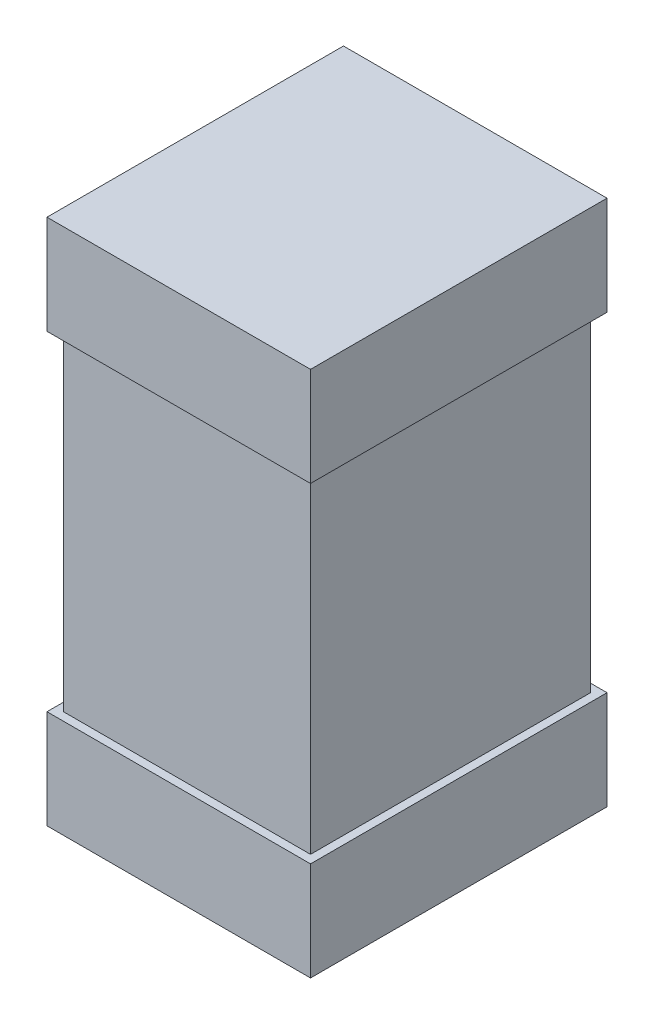
ISO-10303-21;
HEADER;
FILE_DESCRIPTION(('STEP AP214'),'2;1');
FILE_NAME('part.step','',(''),(''),'','','');
FILE_SCHEMA(('AUTOMOTIVE_DESIGN { 1 0 10303 214 1 1 1 1 }'));
ENDSEC;
DATA;
#1=APPLICATION_CONTEXT('core data for automotive mechanical design processes');
#2=APPLICATION_PROTOCOL_DEFINITION('international standard','automotive_design',2000,#1);
#3=PRODUCT_CONTEXT('',#1,'mechanical');
#4=PRODUCT('Part','Part','',(#3));
#5=PRODUCT_RELATED_PRODUCT_CATEGORY('part','',(#4));
#6=PRODUCT_DEFINITION_FORMATION('','',#4);
#7=PRODUCT_DEFINITION_CONTEXT('part definition',#1,'design');
#8=PRODUCT_DEFINITION('design','',#6,#7);
#9=PRODUCT_DEFINITION_SHAPE('','',#8);
#10=(LENGTH_UNIT() NAMED_UNIT(*) SI_UNIT(.MILLI.,.METRE.));
#11=(NAMED_UNIT(*) PLANE_ANGLE_UNIT() SI_UNIT($,.RADIAN.));
#12=(NAMED_UNIT(*) SI_UNIT($,.STERADIAN.) SOLID_ANGLE_UNIT());
#13=UNCERTAINTY_MEASURE_WITH_UNIT(LENGTH_MEASURE(1.E-05),#10,'distance_accuracy_value','');
#14=(GEOMETRIC_REPRESENTATION_CONTEXT(3) GLOBAL_UNCERTAINTY_ASSIGNED_CONTEXT((#13)) GLOBAL_UNIT_ASSIGNED_CONTEXT((#10,
#11,#12)) REPRESENTATION_CONTEXT('',''));
#15=CARTESIAN_POINT('',(0.,0.,0.));
#16=DIRECTION('',(0.,0.,1.));
#17=DIRECTION('',(1.,0.,0.));
#18=AXIS2_PLACEMENT_3D('',#15,#16,#17);
#19=CARTESIAN_POINT('',(-0.375,-0.8,-0.425));
#20=DIRECTION('',(0.,-1.,0.));
#21=DIRECTION('',(0.,0.,-1.));
#22=AXIS2_PLACEMENT_3D('',#19,#20,#21);
#23=PLANE('',#22);
#24=DIRECTION('',(0.,0.,-1.));
#25=VECTOR('',#24,1.);
#26=CARTESIAN_POINT('',(0.4,-0.8,-0.45));
#27=LINE('',#26,#25);
#28=CARTESIAN_POINT('',(0.4,-0.8,0.45));
#29=VERTEX_POINT('',#28);
#30=CARTESIAN_POINT('',(0.4,-0.8,-0.45));
#31=VERTEX_POINT('',#30);
#32=EDGE_CURVE('E107',#29,#31,#27,.T.);
#33=ORIENTED_EDGE('',*,*,#32,.F.);
#34=DIRECTION('',(1.,0.,0.));
#35=VECTOR('',#34,1.);
#36=CARTESIAN_POINT('',(0.4,-0.8,0.45));
#37=LINE('',#36,#35);
#38=CARTESIAN_POINT('',(-0.4,-0.8,0.45));
#39=VERTEX_POINT('',#38);
#40=EDGE_CURVE('E102',#39,#29,#37,.T.);
#41=ORIENTED_EDGE('',*,*,#40,.F.);
#42=DIRECTION('',(0.,0.,1.));
#43=VECTOR('',#42,1.);
#44=CARTESIAN_POINT('',(-0.4,-0.8,0.45));
#45=LINE('',#44,#43);
#46=CARTESIAN_POINT('',(-0.4,-0.8,-0.45));
#47=VERTEX_POINT('',#46);
#48=EDGE_CURVE('E117',#47,#39,#45,.T.);
#49=ORIENTED_EDGE('',*,*,#48,.F.);
#50=DIRECTION('',(-1.,0.,0.));
#51=VECTOR('',#50,1.);
#52=CARTESIAN_POINT('',(-0.4,-0.8,-0.45));
#53=LINE('',#52,#51);
#54=EDGE_CURVE('E19',#31,#47,#53,.T.);
#55=ORIENTED_EDGE('',*,*,#54,.F.);
#56=EDGE_LOOP('',(#33,#41,#49,#55));
#57=FACE_BOUND('',#56,.T.);
#58=ADVANCED_FACE('F16',(#57),#23,.T.);
#59=CARTESIAN_POINT('',(-0.375,0.8,-0.425));
#60=DIRECTION('',(0.,-1.,0.));
#61=DIRECTION('',(0.,0.,-1.));
#62=AXIS2_PLACEMENT_3D('',#59,#60,#61);
#63=PLANE('',#62);
#64=DIRECTION('',(0.,0.,1.));
#65=VECTOR('',#64,1.);
#66=CARTESIAN_POINT('',(-0.4,0.8,-0.45));
#67=LINE('',#66,#65);
#68=CARTESIAN_POINT('',(-0.4,0.8,0.45));
#69=VERTEX_POINT('',#68);
#70=CARTESIAN_POINT('',(-0.4,0.8,-0.45));
#71=VERTEX_POINT('',#70);
#72=EDGE_CURVE('E133',#69,#71,#67,.F.);
#73=ORIENTED_EDGE('',*,*,#72,.F.);
#74=DIRECTION('',(1.,0.,0.));
#75=VECTOR('',#74,1.);
#76=CARTESIAN_POINT('',(-0.4,0.8,0.45));
#77=LINE('',#76,#75);
#78=CARTESIAN_POINT('',(0.4,0.8,0.45));
#79=VERTEX_POINT('',#78);
#80=EDGE_CURVE('E135',#79,#69,#77,.F.);
#81=ORIENTED_EDGE('',*,*,#80,.F.);
#82=DIRECTION('',(0.,0.,-1.));
#83=VECTOR('',#82,1.);
#84=CARTESIAN_POINT('',(0.4,0.8,0.45));
#85=LINE('',#84,#83);
#86=CARTESIAN_POINT('',(0.4,0.8,-0.45));
#87=VERTEX_POINT('',#86);
#88=EDGE_CURVE('E139',#87,#79,#85,.F.);
#89=ORIENTED_EDGE('',*,*,#88,.F.);
#90=DIRECTION('',(-1.,0.,0.));
#91=VECTOR('',#90,1.);
#92=CARTESIAN_POINT('',(0.4,0.8,-0.45));
#93=LINE('',#92,#91);
#94=EDGE_CURVE('E143',#71,#87,#93,.F.);
#95=ORIENTED_EDGE('',*,*,#94,.F.);
#96=EDGE_LOOP('',(#73,#81,#89,#95));
#97=FACE_BOUND('',#96,.T.);
#98=ADVANCED_FACE('F235',(#97),#63,.F.);
#99=CARTESIAN_POINT('',(-0.4,-0.5,-0.45));
#100=DIRECTION('',(0.,0.,-1.));
#101=DIRECTION('',(-1.,0.,0.));
#102=AXIS2_PLACEMENT_3D('',#99,#100,#101);
#103=PLANE('',#102);
#104=DIRECTION('',(1.,0.,0.));
#105=VECTOR('',#104,1.);
#106=CARTESIAN_POINT('',(-0.4,-0.5,-0.45));
#107=LINE('',#106,#105);
#108=CARTESIAN_POINT('',(-0.4,-0.5,-0.45));
#109=VERTEX_POINT('',#108);
#110=CARTESIAN_POINT('',(0.4,-0.5,-0.45));
#111=VERTEX_POINT('',#110);
#112=EDGE_CURVE('E123',#109,#111,#107,.T.);
#113=ORIENTED_EDGE('',*,*,#112,.T.);
#114=DIRECTION('',(0.,1.,0.));
#115=VECTOR('',#114,1.);
#116=CARTESIAN_POINT('',(0.4,-0.5,-0.45));
#117=LINE('',#116,#115);
#118=EDGE_CURVE('E112',#31,#111,#117,.T.);
#119=ORIENTED_EDGE('',*,*,#118,.F.);
#120=ORIENTED_EDGE('',*,*,#54,.T.);
#121=DIRECTION('',(0.,1.,0.));
#122=VECTOR('',#121,1.);
#123=CARTESIAN_POINT('',(-0.4,-0.5,-0.45));
#124=LINE('',#123,#122);
#125=EDGE_CURVE('E131',#109,#47,#124,.F.);
#126=ORIENTED_EDGE('',*,*,#125,.F.);
#127=EDGE_LOOP('',(#113,#119,#120,#126));
#128=FACE_BOUND('',#127,.T.);
#129=ADVANCED_FACE('F122',(#128),#103,.T.);
#130=CARTESIAN_POINT('',(0.4,-0.5,-0.45));
#131=DIRECTION('',(1.,0.,0.));
#132=DIRECTION('',(0.,0.,-1.));
#133=AXIS2_PLACEMENT_3D('',#130,#131,#132);
#134=PLANE('',#133);
#135=DIRECTION('',(0.,0.,-1.));
#136=VECTOR('',#135,1.);
#137=CARTESIAN_POINT('',(0.4,-0.5,-0.45));
#138=LINE('',#137,#136);
#139=CARTESIAN_POINT('',(0.4,-0.5,0.45));
#140=VERTEX_POINT('',#139);
#141=EDGE_CURVE('E153',#111,#140,#138,.F.);
#142=ORIENTED_EDGE('',*,*,#141,.T.);
#143=DIRECTION('',(0.,1.,0.));
#144=VECTOR('',#143,1.);
#145=CARTESIAN_POINT('',(0.4,-0.5,0.45));
#146=LINE('',#145,#144);
#147=EDGE_CURVE('E114',#29,#140,#146,.T.);
#148=ORIENTED_EDGE('',*,*,#147,.F.);
#149=ORIENTED_EDGE('',*,*,#32,.T.);
#150=ORIENTED_EDGE('',*,*,#118,.T.);
#151=EDGE_LOOP('',(#142,#148,#149,#150));
#152=FACE_BOUND('',#151,.T.);
#153=ADVANCED_FACE('F110',(#152),#134,.T.);
#154=CARTESIAN_POINT('',(0.4,-0.5,0.45));
#155=DIRECTION('',(0.,0.,1.));
#156=DIRECTION('',(1.,0.,0.));
#157=AXIS2_PLACEMENT_3D('',#154,#155,#156);
#158=PLANE('',#157);
#159=DIRECTION('',(1.,0.,0.));
#160=VECTOR('',#159,1.);
#161=CARTESIAN_POINT('',(-0.4,-0.5,0.45));
#162=LINE('',#161,#160);
#163=CARTESIAN_POINT('',(-0.4,-0.5,0.45));
#164=VERTEX_POINT('',#163);
#165=EDGE_CURVE('E155',#140,#164,#162,.F.);
#166=ORIENTED_EDGE('',*,*,#165,.T.);
#167=DIRECTION('',(0.,1.,0.));
#168=VECTOR('',#167,1.);
#169=CARTESIAN_POINT('',(-0.4,-0.5,0.45));
#170=LINE('',#169,#168);
#171=EDGE_CURVE('E129',#39,#164,#170,.T.);
#172=ORIENTED_EDGE('',*,*,#171,.F.);
#173=ORIENTED_EDGE('',*,*,#40,.T.);
#174=ORIENTED_EDGE('',*,*,#147,.T.);
#175=EDGE_LOOP('',(#166,#172,#173,#174));
#176=FACE_BOUND('',#175,.T.);
#177=ADVANCED_FACE('F269',(#176),#158,.T.);
#178=CARTESIAN_POINT('',(-0.4,-0.5,0.45));
#179=DIRECTION('',(-1.,0.,0.));
#180=DIRECTION('',(0.,0.,1.));
#181=AXIS2_PLACEMENT_3D('',#178,#179,#180);
#182=PLANE('',#181);
#183=DIRECTION('',(0.,0.,-1.));
#184=VECTOR('',#183,1.);
#185=CARTESIAN_POINT('',(-0.4,-0.5,-0.45));
#186=LINE('',#185,#184);
#187=EDGE_CURVE('E158',#164,#109,#186,.T.);
#188=ORIENTED_EDGE('',*,*,#187,.T.);
#189=ORIENTED_EDGE('',*,*,#125,.T.);
#190=ORIENTED_EDGE('',*,*,#48,.T.);
#191=ORIENTED_EDGE('',*,*,#171,.T.);
#192=EDGE_LOOP('',(#188,#189,#190,#191));
#193=FACE_BOUND('',#192,.T.);
#194=ADVANCED_FACE('F266',(#193),#182,.T.);
#195=CARTESIAN_POINT('',(-0.4,0.5,-0.45));
#196=DIRECTION('',(-1.,0.,0.));
#197=DIRECTION('',(0.,0.,1.));
#198=AXIS2_PLACEMENT_3D('',#195,#196,#197);
#199=PLANE('',#198);
#200=DIRECTION('',(0.,0.,1.));
#201=VECTOR('',#200,1.);
#202=CARTESIAN_POINT('',(-0.4,0.5,-0.45));
#203=LINE('',#202,#201);
#204=CARTESIAN_POINT('',(-0.4,0.5,-0.45));
#205=VERTEX_POINT('',#204);
#206=CARTESIAN_POINT('',(-0.4,0.5,0.45));
#207=VERTEX_POINT('',#206);
#208=EDGE_CURVE('E171',#205,#207,#203,.T.);
#209=ORIENTED_EDGE('',*,*,#208,.T.);
#210=DIRECTION('',(0.,1.,0.));
#211=VECTOR('',#210,1.);
#212=CARTESIAN_POINT('',(-0.4,0.5,0.45));
#213=LINE('',#212,#211);
#214=EDGE_CURVE('E137',#69,#207,#213,.F.);
#215=ORIENTED_EDGE('',*,*,#214,.F.);
#216=ORIENTED_EDGE('',*,*,#72,.T.);
#217=DIRECTION('',(0.,1.,0.));
#218=VECTOR('',#217,1.);
#219=CARTESIAN_POINT('',(-0.4,0.5,-0.45));
#220=LINE('',#219,#218);
#221=EDGE_CURVE('E147',#205,#71,#220,.T.);
#222=ORIENTED_EDGE('',*,*,#221,.F.);
#223=EDGE_LOOP('',(#209,#215,#216,#222));
#224=FACE_BOUND('',#223,.T.);
#225=ADVANCED_FACE('F227',(#224),#199,.T.);
#226=CARTESIAN_POINT('',(-0.4,0.5,0.45));
#227=DIRECTION('',(0.,0.,1.));
#228=DIRECTION('',(1.,0.,0.));
#229=AXIS2_PLACEMENT_3D('',#226,#227,#228);
#230=PLANE('',#229);
#231=DIRECTION('',(1.,0.,0.));
#232=VECTOR('',#231,1.);
#233=CARTESIAN_POINT('',(-0.4,0.5,0.45));
#234=LINE('',#233,#232);
#235=CARTESIAN_POINT('',(0.4,0.5,0.45));
#236=VERTEX_POINT('',#235);
#237=EDGE_CURVE('E174',#207,#236,#234,.T.);
#238=ORIENTED_EDGE('',*,*,#237,.T.);
#239=DIRECTION('',(0.,1.,0.));
#240=VECTOR('',#239,1.);
#241=CARTESIAN_POINT('',(0.4,0.5,0.45));
#242=LINE('',#241,#240);
#243=EDGE_CURVE('E141',#79,#236,#242,.F.);
#244=ORIENTED_EDGE('',*,*,#243,.F.);
#245=ORIENTED_EDGE('',*,*,#80,.T.);
#246=ORIENTED_EDGE('',*,*,#214,.T.);
#247=EDGE_LOOP('',(#238,#244,#245,#246));
#248=FACE_BOUND('',#247,.T.);
#249=ADVANCED_FACE('F222',(#248),#230,.T.);
#250=CARTESIAN_POINT('',(0.4,0.5,0.45));
#251=DIRECTION('',(1.,0.,0.));
#252=DIRECTION('',(0.,0.,-1.));
#253=AXIS2_PLACEMENT_3D('',#250,#251,#252);
#254=PLANE('',#253);
#255=DIRECTION('',(0.,0.,1.));
#256=VECTOR('',#255,1.);
#257=CARTESIAN_POINT('',(0.4,0.5,-0.45));
#258=LINE('',#257,#256);
#259=CARTESIAN_POINT('',(0.4,0.5,-0.45));
#260=VERTEX_POINT('',#259);
#261=EDGE_CURVE('E177',#236,#260,#258,.F.);
#262=ORIENTED_EDGE('',*,*,#261,.T.);
#263=DIRECTION('',(0.,1.,0.));
#264=VECTOR('',#263,1.);
#265=CARTESIAN_POINT('',(0.4,0.5,-0.45));
#266=LINE('',#265,#264);
#267=EDGE_CURVE('E145',#87,#260,#266,.F.);
#268=ORIENTED_EDGE('',*,*,#267,.F.);
#269=ORIENTED_EDGE('',*,*,#88,.T.);
#270=ORIENTED_EDGE('',*,*,#243,.T.);
#271=EDGE_LOOP('',(#262,#268,#269,#270));
#272=FACE_BOUND('',#271,.T.);
#273=ADVANCED_FACE('F233',(#272),#254,.T.);
#274=CARTESIAN_POINT('',(0.4,0.5,-0.45));
#275=DIRECTION('',(0.,0.,-1.));
#276=DIRECTION('',(-1.,0.,0.));
#277=AXIS2_PLACEMENT_3D('',#274,#275,#276);
#278=PLANE('',#277);
#279=DIRECTION('',(1.,0.,0.));
#280=VECTOR('',#279,1.);
#281=CARTESIAN_POINT('',(-0.4,0.5,-0.45));
#282=LINE('',#281,#280);
#283=EDGE_CURVE('E180',#260,#205,#282,.F.);
#284=ORIENTED_EDGE('',*,*,#283,.T.);
#285=ORIENTED_EDGE('',*,*,#221,.T.);
#286=ORIENTED_EDGE('',*,*,#94,.T.);
#287=ORIENTED_EDGE('',*,*,#267,.T.);
#288=EDGE_LOOP('',(#284,#285,#286,#287));
#289=FACE_BOUND('',#288,.T.);
#290=ADVANCED_FACE('F231',(#289),#278,.T.);
#291=CARTESIAN_POINT('',(-0.375,-0.8,0.425));
#292=DIRECTION('',(1.,0.,0.));
#293=DIRECTION('',(0.,0.,-1.));
#294=AXIS2_PLACEMENT_3D('',#291,#292,#293);
#295=PLANE('',#294);
#296=DIRECTION('',(0.,1.,0.));
#297=VECTOR('',#296,1.);
#298=CARTESIAN_POINT('',(-0.375,-0.8,-0.425));
#299=LINE('',#298,#297);
#300=CARTESIAN_POINT('',(-0.375,0.5,-0.425));
#301=VERTEX_POINT('',#300);
#302=CARTESIAN_POINT('',(-0.375,-0.5,-0.425));
#303=VERTEX_POINT('',#302);
#304=EDGE_CURVE('E150',#301,#303,#299,.F.);
#305=ORIENTED_EDGE('',*,*,#304,.T.);
#306=DIRECTION('',(0.,0.,-1.));
#307=VECTOR('',#306,1.);
#308=CARTESIAN_POINT('',(-0.375,-0.5,-0.45));
#309=LINE('',#308,#307);
#310=CARTESIAN_POINT('',(-0.375,-0.5,0.425));
#311=VERTEX_POINT('',#310);
#312=EDGE_CURVE('E164',#303,#311,#309,.F.);
#313=ORIENTED_EDGE('',*,*,#312,.T.);
#314=DIRECTION('',(0.,1.,0.));
#315=VECTOR('',#314,1.);
#316=CARTESIAN_POINT('',(-0.375,-0.8,0.425));
#317=LINE('',#316,#315);
#318=CARTESIAN_POINT('',(-0.375,0.5,0.425));
#319=VERTEX_POINT('',#318);
#320=EDGE_CURVE('E169',#311,#319,#317,.T.);
#321=ORIENTED_EDGE('',*,*,#320,.T.);
#322=DIRECTION('',(0.,0.,1.));
#323=VECTOR('',#322,1.);
#324=CARTESIAN_POINT('',(-0.375,0.5,-0.45));
#325=LINE('',#324,#323);
#326=EDGE_CURVE('E184',#319,#301,#325,.F.);
#327=ORIENTED_EDGE('',*,*,#326,.T.);
#328=EDGE_LOOP('',(#305,#313,#321,#327));
#329=FACE_BOUND('',#328,.T.);
#330=ADVANCED_FACE('F254',(#329),#295,.F.);
#331=CARTESIAN_POINT('',(-0.375,-0.8,-0.425));
#332=DIRECTION('',(0.,0.,1.));
#333=DIRECTION('',(1.,0.,0.));
#334=AXIS2_PLACEMENT_3D('',#331,#332,#333);
#335=PLANE('',#334);
#336=DIRECTION('',(0.,1.,0.));
#337=VECTOR('',#336,1.);
#338=CARTESIAN_POINT('',(0.375,-0.8,-0.425));
#339=LINE('',#338,#337);
#340=CARTESIAN_POINT('',(0.375,0.5,-0.425));
#341=VERTEX_POINT('',#340);
#342=CARTESIAN_POINT('',(0.375,-0.5,-0.425));
#343=VERTEX_POINT('',#342);
#344=EDGE_CURVE('E190',#341,#343,#339,.F.);
#345=ORIENTED_EDGE('',*,*,#344,.T.);
#346=DIRECTION('',(1.,0.,0.));
#347=VECTOR('',#346,1.);
#348=CARTESIAN_POINT('',(-0.4,-0.5,-0.425));
#349=LINE('',#348,#347);
#350=EDGE_CURVE('E161',#343,#303,#349,.F.);
#351=ORIENTED_EDGE('',*,*,#350,.T.);
#352=ORIENTED_EDGE('',*,*,#304,.F.);
#353=DIRECTION('',(1.,0.,0.));
#354=VECTOR('',#353,1.);
#355=CARTESIAN_POINT('',(-0.4,0.5,-0.425));
#356=LINE('',#355,#354);
#357=EDGE_CURVE('E187',#301,#341,#356,.T.);
#358=ORIENTED_EDGE('',*,*,#357,.T.);
#359=EDGE_LOOP('',(#345,#351,#352,#358));
#360=FACE_BOUND('',#359,.T.);
#361=ADVANCED_FACE('F209',(#360),#335,.F.);
#362=CARTESIAN_POINT('',(-0.4,-0.5,-0.45));
#363=DIRECTION('',(0.,-1.,0.));
#364=DIRECTION('',(0.,0.,-1.));
#365=AXIS2_PLACEMENT_3D('',#362,#363,#364);
#366=PLANE('',#365);
#367=ORIENTED_EDGE('',*,*,#312,.F.);
#368=ORIENTED_EDGE('',*,*,#350,.F.);
#369=DIRECTION('',(0.,0.,1.));
#370=VECTOR('',#369,1.);
#371=CARTESIAN_POINT('',(0.375,-0.5,-0.425));
#372=LINE('',#371,#370);
#373=CARTESIAN_POINT('',(0.375,-0.5,0.425));
#374=VERTEX_POINT('',#373);
#375=EDGE_CURVE('E193',#343,#374,#372,.T.);
#376=ORIENTED_EDGE('',*,*,#375,.T.);
#377=DIRECTION('',(-1.,0.,0.));
#378=VECTOR('',#377,1.);
#379=CARTESIAN_POINT('',(0.375,-0.5,0.425));
#380=LINE('',#379,#378);
#381=EDGE_CURVE('E166',#374,#311,#380,.T.);
#382=ORIENTED_EDGE('',*,*,#381,.T.);
#383=EDGE_LOOP('',(#367,#368,#376,#382));
#384=FACE_BOUND('',#383,.T.);
#385=ORIENTED_EDGE('',*,*,#165,.F.);
#386=ORIENTED_EDGE('',*,*,#141,.F.);
#387=ORIENTED_EDGE('',*,*,#112,.F.);
#388=ORIENTED_EDGE('',*,*,#187,.F.);
#389=EDGE_LOOP('',(#385,#386,#387,#388));
#390=FACE_BOUND('',#389,.T.);
#391=ADVANCED_FACE('F206',(#384,#390),#366,.F.);
#392=CARTESIAN_POINT('',(0.375,-0.8,0.425));
#393=DIRECTION('',(0.,0.,-1.));
#394=DIRECTION('',(-1.,0.,0.));
#395=AXIS2_PLACEMENT_3D('',#392,#393,#394);
#396=PLANE('',#395);
#397=ORIENTED_EDGE('',*,*,#320,.F.);
#398=ORIENTED_EDGE('',*,*,#381,.F.);
#399=DIRECTION('',(0.,1.,0.));
#400=VECTOR('',#399,1.);
#401=CARTESIAN_POINT('',(0.375,-0.8,0.425));
#402=LINE('',#401,#400);
#403=CARTESIAN_POINT('',(0.375,0.5,0.425));
#404=VERTEX_POINT('',#403);
#405=EDGE_CURVE('E25',#374,#404,#402,.T.);
#406=ORIENTED_EDGE('',*,*,#405,.T.);
#407=DIRECTION('',(1.,0.,0.));
#408=VECTOR('',#407,1.);
#409=CARTESIAN_POINT('',(-0.4,0.5,0.425));
#410=LINE('',#409,#408);
#411=EDGE_CURVE('E33',#404,#319,#410,.F.);
#412=ORIENTED_EDGE('',*,*,#411,.T.);
#413=EDGE_LOOP('',(#397,#398,#406,#412));
#414=FACE_BOUND('',#413,.T.);
#415=ADVANCED_FACE('F200',(#414),#396,.F.);
#416=CARTESIAN_POINT('',(-0.4,0.5,-0.45));
#417=DIRECTION('',(0.,1.,0.));
#418=DIRECTION('',(0.,0.,1.));
#419=AXIS2_PLACEMENT_3D('',#416,#417,#418);
#420=PLANE('',#419);
#421=ORIENTED_EDGE('',*,*,#326,.F.);
#422=ORIENTED_EDGE('',*,*,#411,.F.);
#423=DIRECTION('',(0.,0.,1.));
#424=VECTOR('',#423,1.);
#425=CARTESIAN_POINT('',(0.375,0.5,-0.425));
#426=LINE('',#425,#424);
#427=EDGE_CURVE('E11',#404,#341,#426,.F.);
#428=ORIENTED_EDGE('',*,*,#427,.T.);
#429=ORIENTED_EDGE('',*,*,#357,.F.);
#430=EDGE_LOOP('',(#421,#422,#428,#429));
#431=FACE_BOUND('',#430,.T.);
#432=ORIENTED_EDGE('',*,*,#261,.F.);
#433=ORIENTED_EDGE('',*,*,#237,.F.);
#434=ORIENTED_EDGE('',*,*,#208,.F.);
#435=ORIENTED_EDGE('',*,*,#283,.F.);
#436=EDGE_LOOP('',(#432,#433,#434,#435));
#437=FACE_BOUND('',#436,.T.);
#438=ADVANCED_FACE('F211',(#431,#437),#420,.F.);
#439=CARTESIAN_POINT('',(0.375,-0.8,-0.425));
#440=DIRECTION('',(-1.,0.,0.));
#441=DIRECTION('',(0.,0.,1.));
#442=AXIS2_PLACEMENT_3D('',#439,#440,#441);
#443=PLANE('',#442);
#444=ORIENTED_EDGE('',*,*,#405,.F.);
#445=ORIENTED_EDGE('',*,*,#375,.F.);
#446=ORIENTED_EDGE('',*,*,#344,.F.);
#447=ORIENTED_EDGE('',*,*,#427,.F.);
#448=EDGE_LOOP('',(#444,#445,#446,#447));
#449=FACE_BOUND('',#448,.T.);
#450=ADVANCED_FACE('F203',(#449),#443,.F.);
#451=CLOSED_SHELL('',(#58,#98,#129,#153,#177,#194,#225,#249,#273,#290,#330,#361,#391,#415,#438,#450));
#452=MANIFOLD_SOLID_BREP('B1',#451);
#453=ADVANCED_BREP_SHAPE_REPRESENTATION('',(#18,#452),#14);
#454=SHAPE_DEFINITION_REPRESENTATION(#9,#453);
ENDSEC;
END-ISO-10303-21;
